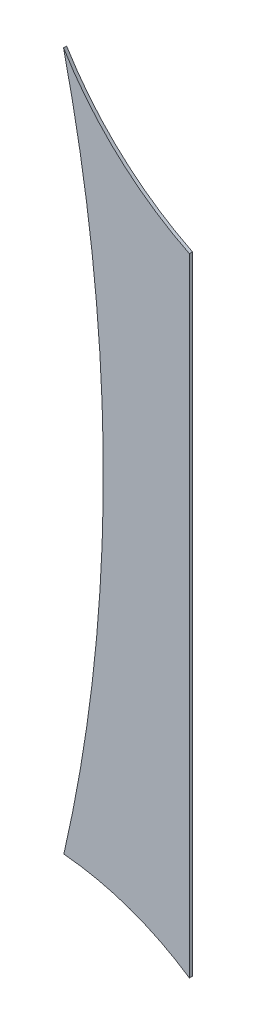
ISO-10303-21;
HEADER;
FILE_DESCRIPTION(('STEP AP214'),'2;1');
FILE_NAME('part.step','',(''),(''),'','','');
FILE_SCHEMA(('AUTOMOTIVE_DESIGN { 1 0 10303 214 1 1 1 1 }'));
ENDSEC;
DATA;
#1=APPLICATION_CONTEXT('core data for automotive mechanical design processes');
#2=APPLICATION_PROTOCOL_DEFINITION('international standard','automotive_design',2000,#1);
#3=PRODUCT_CONTEXT('',#1,'mechanical');
#4=PRODUCT('Part','Part','',(#3));
#5=PRODUCT_RELATED_PRODUCT_CATEGORY('part','',(#4));
#6=PRODUCT_DEFINITION_FORMATION('','',#4);
#7=PRODUCT_DEFINITION_CONTEXT('part definition',#1,'design');
#8=PRODUCT_DEFINITION('design','',#6,#7);
#9=PRODUCT_DEFINITION_SHAPE('','',#8);
#10=(LENGTH_UNIT() NAMED_UNIT(*) SI_UNIT(.MILLI.,.METRE.));
#11=(NAMED_UNIT(*) PLANE_ANGLE_UNIT() SI_UNIT($,.RADIAN.));
#12=(NAMED_UNIT(*) SI_UNIT($,.STERADIAN.) SOLID_ANGLE_UNIT());
#13=UNCERTAINTY_MEASURE_WITH_UNIT(LENGTH_MEASURE(1.E-05),#10,'distance_accuracy_value','');
#14=(GEOMETRIC_REPRESENTATION_CONTEXT(3) GLOBAL_UNCERTAINTY_ASSIGNED_CONTEXT((#13)) GLOBAL_UNIT_ASSIGNED_CONTEXT((#10,
#11,#12)) REPRESENTATION_CONTEXT('',''));
#15=CARTESIAN_POINT('',(0.,0.,0.));
#16=DIRECTION('',(0.,0.,1.));
#17=DIRECTION('',(1.,0.,0.));
#18=AXIS2_PLACEMENT_3D('',#15,#16,#17);
#19=CARTESIAN_POINT('',(-31.7733525351339,4.98902629867014,0.1));
#20=DIRECTION('',(0.,0.,-1.));
#21=DIRECTION('',(-1.,0.,0.));
#22=AXIS2_PLACEMENT_3D('',#19,#20,#21);
#23=CYLINDRICAL_SURFACE('',#22,50.1291294308308);
#24=CARTESIAN_POINT('',(-31.7733525351339,4.98902629867014,0.));
#25=DIRECTION('',(0.,0.,1.));
#26=DIRECTION('',(1.,0.,0.));
#27=AXIS2_PLACEMENT_3D('',#24,#25,#26);
#28=CIRCLE('',#27,50.1291294308308);
#29=CARTESIAN_POINT('',(17.0844058562837,-6.22922055450822,0.));
#30=VERTEX_POINT('',#29);
#31=CARTESIAN_POINT('',(17.0735564522515,16.2544202052794,0.));
#32=VERTEX_POINT('',#31);
#33=EDGE_CURVE('E97',#30,#32,#28,.T.);
#34=ORIENTED_EDGE('',*,*,#33,.F.);
#35=DIRECTION('',(0.,0.,-1.));
#36=VECTOR('',#35,1.);
#37=CARTESIAN_POINT('',(17.0844058562837,-6.22922055450822,0.1));
#38=LINE('',#37,#36);
#39=CARTESIAN_POINT('',(17.0844058562837,-6.22922055450822,0.1));
#40=VERTEX_POINT('',#39);
#41=EDGE_CURVE('E11',#40,#30,#38,.T.);
#42=ORIENTED_EDGE('',*,*,#41,.F.);
#43=CARTESIAN_POINT('',(-31.7733525351339,4.98902629867014,0.1));
#44=DIRECTION('',(0.,0.,1.));
#45=DIRECTION('',(1.,0.,0.));
#46=AXIS2_PLACEMENT_3D('',#43,#44,#45);
#47=CIRCLE('',#46,50.1291294308308);
#48=CARTESIAN_POINT('',(17.0735564522515,16.2544202052794,0.1));
#49=VERTEX_POINT('',#48);
#50=EDGE_CURVE('E91',#40,#49,#47,.T.);
#51=ORIENTED_EDGE('',*,*,#50,.T.);
#52=DIRECTION('',(0.,0.,-1.));
#53=VECTOR('',#52,1.);
#54=CARTESIAN_POINT('',(17.0735564522515,16.2544202052794,0.1));
#55=LINE('',#54,#53);
#56=EDGE_CURVE('E49',#49,#32,#55,.T.);
#57=ORIENTED_EDGE('',*,*,#56,.T.);
#58=EDGE_LOOP('',(#34,#42,#51,#57));
#59=FACE_BOUND('',#58,.T.);
#60=ADVANCED_FACE('F33',(#59),#23,.F.);
#61=CARTESIAN_POINT('',(16.3397934282804,-14.7460862290571,0.1));
#62=DIRECTION('',(0.,0.,-1.));
#63=DIRECTION('',(-1.,0.,0.));
#64=AXIS2_PLACEMENT_3D('',#61,#62,#63);
#65=CYLINDRICAL_SURFACE('',#64,8.54935369406639);
#66=CARTESIAN_POINT('',(16.3397934282804,-14.7460862290571,0.));
#67=DIRECTION('',(0.,0.,1.));
#68=DIRECTION('',(1.,0.,0.));
#69=AXIS2_PLACEMENT_3D('',#66,#67,#68);
#70=CIRCLE('',#69,8.54935369406639);
#71=CARTESIAN_POINT('',(21.1279241105687,-7.66334289362724,0.));
#72=VERTEX_POINT('',#71);
#73=EDGE_CURVE('E81',#72,#30,#70,.T.);
#74=ORIENTED_EDGE('',*,*,#73,.F.);
#75=DIRECTION('',(0.,0.,-1.));
#76=VECTOR('',#75,1.);
#77=CARTESIAN_POINT('',(21.1279241105687,-7.66334289362724,0.1));
#78=LINE('',#77,#76);
#79=CARTESIAN_POINT('',(21.1279241105687,-7.66334289362724,0.1));
#80=VERTEX_POINT('',#79);
#81=EDGE_CURVE('E41',#80,#72,#78,.T.);
#82=ORIENTED_EDGE('',*,*,#81,.F.);
#83=CARTESIAN_POINT('',(16.3397934282804,-14.7460862290571,0.1));
#84=DIRECTION('',(0.,0.,1.));
#85=DIRECTION('',(1.,0.,0.));
#86=AXIS2_PLACEMENT_3D('',#83,#84,#85);
#87=CIRCLE('',#86,8.54935369406639);
#88=EDGE_CURVE('E79',#80,#40,#87,.T.);
#89=ORIENTED_EDGE('',*,*,#88,.T.);
#90=ORIENTED_EDGE('',*,*,#41,.T.);
#91=EDGE_LOOP('',(#74,#82,#89,#90));
#92=FACE_BOUND('',#91,.T.);
#93=ADVANCED_FACE('F77',(#92),#65,.F.);
#94=CARTESIAN_POINT('',(21.1271959790847,0.00200687209726957,0.1));
#95=DIRECTION('',(-0.999999995488451,-9.49899877959297E-05,0.));
#96=DIRECTION('',(9.49899877959297E-05,-0.999999995488451,0.));
#97=AXIS2_PLACEMENT_3D('',#94,#95,#96);
#98=PLANE('',#97);
#99=DIRECTION('',(-9.49899877959297E-05,0.999999995488451,0.));
#100=VECTOR('',#99,1.);
#101=CARTESIAN_POINT('',(21.1271959790847,0.00200687209726957,0.));
#102=LINE('',#101,#100);
#103=CARTESIAN_POINT('',(21.1260050200664,12.5397389057734,0.));
#104=VERTEX_POINT('',#103);
#105=EDGE_CURVE('E100',#72,#104,#102,.T.);
#106=ORIENTED_EDGE('',*,*,#105,.T.);
#107=DIRECTION('',(0.,0.,-1.));
#108=VECTOR('',#107,1.);
#109=CARTESIAN_POINT('',(21.1260050200664,12.5397389057734,0.1));
#110=LINE('',#109,#108);
#111=CARTESIAN_POINT('',(21.1260050200664,12.5397389057734,0.1));
#112=VERTEX_POINT('',#111);
#113=EDGE_CURVE('E63',#112,#104,#110,.T.);
#114=ORIENTED_EDGE('',*,*,#113,.F.);
#115=DIRECTION('',(-9.49899877959297E-05,0.999999995488451,0.));
#116=VECTOR('',#115,1.);
#117=CARTESIAN_POINT('',(21.1271959790847,0.00200687209726957,0.1));
#118=LINE('',#117,#116);
#119=EDGE_CURVE('E84',#80,#112,#118,.T.);
#120=ORIENTED_EDGE('',*,*,#119,.F.);
#121=ORIENTED_EDGE('',*,*,#81,.T.);
#122=EDGE_LOOP('',(#106,#114,#120,#121));
#123=FACE_BOUND('',#122,.T.);
#124=ADVANCED_FACE('F85',(#123),#98,.F.);
#125=CARTESIAN_POINT('',(25.5584681129067,21.4430402448987,0.1));
#126=DIRECTION('',(0.,0.,-1.));
#127=DIRECTION('',(-1.,0.,0.));
#128=AXIS2_PLACEMENT_3D('',#125,#126,#127);
#129=CYLINDRICAL_SURFACE('',#128,9.94562737109439);
#130=CARTESIAN_POINT('',(25.5584681129067,21.4430402448987,0.));
#131=DIRECTION('',(0.,0.,1.));
#132=DIRECTION('',(1.,0.,0.));
#133=AXIS2_PLACEMENT_3D('',#130,#131,#132);
#134=CIRCLE('',#133,9.94562737109439);
#135=EDGE_CURVE('E93',#32,#104,#134,.T.);
#136=ORIENTED_EDGE('',*,*,#135,.F.);
#137=ORIENTED_EDGE('',*,*,#56,.F.);
#138=CARTESIAN_POINT('',(25.5584681129067,21.4430402448987,0.1));
#139=DIRECTION('',(0.,0.,1.));
#140=DIRECTION('',(1.,0.,0.));
#141=AXIS2_PLACEMENT_3D('',#138,#139,#140);
#142=CIRCLE('',#141,9.94562737109439);
#143=EDGE_CURVE('E88',#49,#112,#142,.T.);
#144=ORIENTED_EDGE('',*,*,#143,.T.);
#145=ORIENTED_EDGE('',*,*,#113,.T.);
#146=EDGE_LOOP('',(#136,#137,#144,#145));
#147=FACE_BOUND('',#146,.T.);
#148=ADVANCED_FACE('F107',(#147),#129,.F.);
#149=CARTESIAN_POINT('',(0.,0.,0.1));
#150=DIRECTION('',(0.,0.,1.));
#151=DIRECTION('',(1.,0.,0.));
#152=AXIS2_PLACEMENT_3D('',#149,#150,#151);
#153=PLANE('',#152);
#154=ORIENTED_EDGE('',*,*,#50,.F.);
#155=ORIENTED_EDGE('',*,*,#88,.F.);
#156=ORIENTED_EDGE('',*,*,#119,.T.);
#157=ORIENTED_EDGE('',*,*,#143,.F.);
#158=EDGE_LOOP('',(#154,#155,#156,#157));
#159=FACE_BOUND('',#158,.T.);
#160=ADVANCED_FACE('F90',(#159),#153,.T.);
#161=CARTESIAN_POINT('',(0.,0.,0.));
#162=DIRECTION('',(0.,0.,1.));
#163=DIRECTION('',(1.,0.,0.));
#164=AXIS2_PLACEMENT_3D('',#161,#162,#163);
#165=PLANE('',#164);
#166=ORIENTED_EDGE('',*,*,#33,.T.);
#167=ORIENTED_EDGE('',*,*,#135,.T.);
#168=ORIENTED_EDGE('',*,*,#105,.F.);
#169=ORIENTED_EDGE('',*,*,#73,.T.);
#170=EDGE_LOOP('',(#166,#167,#168,#169));
#171=FACE_BOUND('',#170,.T.);
#172=ADVANCED_FACE('F106',(#171),#165,.F.);
#173=CLOSED_SHELL('',(#60,#93,#124,#148,#160,#172));
#174=MANIFOLD_SOLID_BREP('B2',#173);
#175=ADVANCED_BREP_SHAPE_REPRESENTATION('',(#18,#174),#14);
#176=SHAPE_DEFINITION_REPRESENTATION(#9,#175);
ENDSEC;
END-ISO-10303-21;
